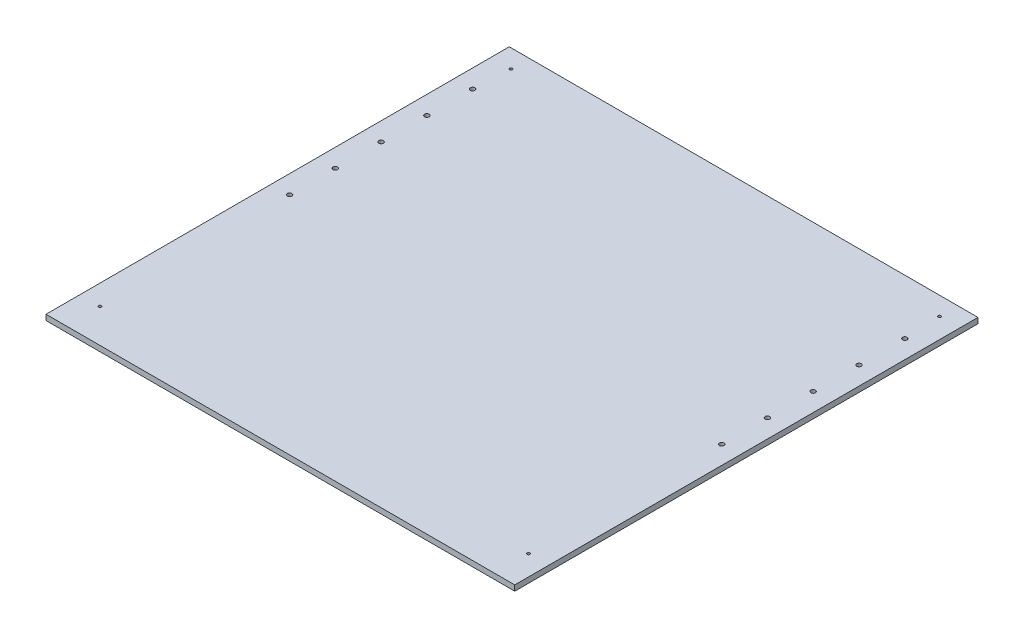
ISO-10303-21;
HEADER;
FILE_DESCRIPTION(('STEP AP214'),'2;1');
FILE_NAME('part.step','',(''),(''),'','','');
FILE_SCHEMA(('AUTOMOTIVE_DESIGN { 1 0 10303 214 1 1 1 1 }'));
ENDSEC;
DATA;
#1=APPLICATION_CONTEXT('core data for automotive mechanical design processes');
#2=APPLICATION_PROTOCOL_DEFINITION('international standard','automotive_design',2000,#1);
#3=PRODUCT_CONTEXT('',#1,'mechanical');
#4=PRODUCT('Part','Part','',(#3));
#5=PRODUCT_RELATED_PRODUCT_CATEGORY('part','',(#4));
#6=PRODUCT_DEFINITION_FORMATION('','',#4);
#7=PRODUCT_DEFINITION_CONTEXT('part definition',#1,'design');
#8=PRODUCT_DEFINITION('design','',#6,#7);
#9=PRODUCT_DEFINITION_SHAPE('','',#8);
#10=(LENGTH_UNIT() NAMED_UNIT(*) SI_UNIT(.MILLI.,.METRE.));
#11=(NAMED_UNIT(*) PLANE_ANGLE_UNIT() SI_UNIT($,.RADIAN.));
#12=(NAMED_UNIT(*) SI_UNIT($,.STERADIAN.) SOLID_ANGLE_UNIT());
#13=UNCERTAINTY_MEASURE_WITH_UNIT(LENGTH_MEASURE(1.E-05),#10,'distance_accuracy_value','');
#14=(GEOMETRIC_REPRESENTATION_CONTEXT(3) GLOBAL_UNCERTAINTY_ASSIGNED_CONTEXT((#13)) GLOBAL_UNIT_ASSIGNED_CONTEXT((#10,
#11,#12)) REPRESENTATION_CONTEXT('',''));
#15=CARTESIAN_POINT('',(0.,0.,0.));
#16=DIRECTION('',(0.,0.,1.));
#17=DIRECTION('',(1.,0.,0.));
#18=AXIS2_PLACEMENT_3D('',#15,#16,#17);
#19=CARTESIAN_POINT('',(0.,6.,0.));
#20=DIRECTION('',(0.,1.,0.));
#21=DIRECTION('',(0.,0.,1.));
#22=AXIS2_PLACEMENT_3D('',#19,#20,#21);
#23=PLANE('',#22);
#24=CARTESIAN_POINT('',(13.9999999999995,6.,210.));
#25=DIRECTION('',(0.,-1.,0.));
#26=DIRECTION('',(0.,0.,-1.));
#27=AXIS2_PLACEMENT_3D('',#24,#25,#26);
#28=CIRCLE('',#27,2.50000000000001);
#29=CARTESIAN_POINT('',(13.9999999999995,6.,207.5));
#30=VERTEX_POINT('',#29);
#31=EDGE_CURVE('E185',#30,#30,#28,.T.);
#32=ORIENTED_EDGE('',*,*,#31,.T.);
#33=EDGE_LOOP('',(#32));
#34=FACE_BOUND('',#33,.T.);
#35=CARTESIAN_POINT('',(13.9999999999997,6.,160.));
#36=DIRECTION('',(0.,-1.,0.));
#37=DIRECTION('',(0.,0.,-1.));
#38=AXIS2_PLACEMENT_3D('',#35,#36,#37);
#39=CIRCLE('',#38,2.5);
#40=CARTESIAN_POINT('',(13.9999999999997,6.,157.5));
#41=VERTEX_POINT('',#40);
#42=EDGE_CURVE('E189',#41,#41,#39,.T.);
#43=ORIENTED_EDGE('',*,*,#42,.T.);
#44=EDGE_LOOP('',(#43));
#45=FACE_BOUND('',#44,.T.);
#46=CARTESIAN_POINT('',(13.9999999999998,6.,110.));
#47=DIRECTION('',(0.,-1.,0.));
#48=DIRECTION('',(0.,0.,-1.));
#49=AXIS2_PLACEMENT_3D('',#46,#47,#48);
#50=CIRCLE('',#49,2.50000000000001);
#51=CARTESIAN_POINT('',(13.9999999999998,6.,107.5));
#52=VERTEX_POINT('',#51);
#53=EDGE_CURVE('E193',#52,#52,#50,.T.);
#54=ORIENTED_EDGE('',*,*,#53,.T.);
#55=EDGE_LOOP('',(#54));
#56=FACE_BOUND('',#55,.T.);
#57=CARTESIAN_POINT('',(14.,6.,60.));
#58=DIRECTION('',(0.,-1.,0.));
#59=DIRECTION('',(0.,0.,-1.));
#60=AXIS2_PLACEMENT_3D('',#57,#58,#59);
#61=CIRCLE('',#60,2.5);
#62=CARTESIAN_POINT('',(14.,6.,57.5));
#63=VERTEX_POINT('',#62);
#64=EDGE_CURVE('E197',#63,#63,#61,.T.);
#65=ORIENTED_EDGE('',*,*,#64,.T.);
#66=EDGE_LOOP('',(#65));
#67=FACE_BOUND('',#66,.T.);
#68=CARTESIAN_POINT('',(486.000000000001,6.,210.));
#69=DIRECTION('',(0.,-1.,0.));
#70=DIRECTION('',(0.,0.,-1.));
#71=AXIS2_PLACEMENT_3D('',#68,#69,#70);
#72=CIRCLE('',#71,2.49999999999997);
#73=CARTESIAN_POINT('',(486.000000000001,6.,207.5));
#74=VERTEX_POINT('',#73);
#75=EDGE_CURVE('E201',#74,#74,#72,.F.);
#76=ORIENTED_EDGE('',*,*,#75,.F.);
#77=EDGE_LOOP('',(#76));
#78=FACE_BOUND('',#77,.T.);
#79=CARTESIAN_POINT('',(486.,6.,110.));
#80=DIRECTION('',(0.,-1.,0.));
#81=DIRECTION('',(0.,0.,-1.));
#82=AXIS2_PLACEMENT_3D('',#79,#80,#81);
#83=CIRCLE('',#82,2.50000000000008);
#84=CARTESIAN_POINT('',(486.,6.,107.5));
#85=VERTEX_POINT('',#84);
#86=EDGE_CURVE('E205',#85,#85,#83,.F.);
#87=ORIENTED_EDGE('',*,*,#86,.F.);
#88=EDGE_LOOP('',(#87));
#89=FACE_BOUND('',#88,.T.);
#90=CARTESIAN_POINT('',(484.,6.,469.));
#91=DIRECTION('',(0.,1.,0.));
#92=DIRECTION('',(0.,0.,1.));
#93=AXIS2_PLACEMENT_3D('',#90,#91,#92);
#94=CIRCLE('',#93,1.50000000000002);
#95=CARTESIAN_POINT('',(484.,6.,470.5));
#96=VERTEX_POINT('',#95);
#97=EDGE_CURVE('E128',#96,#96,#94,.T.);
#98=ORIENTED_EDGE('',*,*,#97,.F.);
#99=EDGE_LOOP('',(#98));
#100=FACE_BOUND('',#99,.T.);
#101=CARTESIAN_POINT('',(16.,6.,19.9999999999999));
#102=DIRECTION('',(0.,1.,0.));
#103=DIRECTION('',(0.,0.,1.));
#104=AXIS2_PLACEMENT_3D('',#101,#102,#103);
#105=CIRCLE('',#104,1.50000000000016);
#106=CARTESIAN_POINT('',(16.,6.,21.5000000000001));
#107=VERTEX_POINT('',#106);
#108=EDGE_CURVE('E144',#107,#107,#105,.T.);
#109=ORIENTED_EDGE('',*,*,#108,.F.);
#110=EDGE_LOOP('',(#109));
#111=FACE_BOUND('',#110,.T.);
#112=DIRECTION('',(-1.,0.,0.));
#113=VECTOR('',#112,1.);
#114=CARTESIAN_POINT('',(0.,6.,0.));
#115=LINE('',#114,#113);
#116=CARTESIAN_POINT('',(506.,6.,0.));
#117=VERTEX_POINT('',#116);
#118=CARTESIAN_POINT('',(-5.99999999999994,6.,-1.11022302462516E-13));
#119=VERTEX_POINT('',#118);
#120=EDGE_CURVE('E11',#117,#119,#115,.T.);
#121=ORIENTED_EDGE('',*,*,#120,.T.);
#122=DIRECTION('',(0.,0.,-1.));
#123=VECTOR('',#122,1.);
#124=CARTESIAN_POINT('',(-6.,6.,506.));
#125=LINE('',#124,#123);
#126=CARTESIAN_POINT('',(-6.,6.,506.));
#127=VERTEX_POINT('',#126);
#128=EDGE_CURVE('E90',#127,#119,#125,.T.);
#129=ORIENTED_EDGE('',*,*,#128,.F.);
#130=DIRECTION('',(-1.,0.,0.));
#131=VECTOR('',#130,1.);
#132=CARTESIAN_POINT('',(506.,6.,506.));
#133=LINE('',#132,#131);
#134=CARTESIAN_POINT('',(506.,6.,506.));
#135=VERTEX_POINT('',#134);
#136=EDGE_CURVE('E100',#135,#127,#133,.T.);
#137=ORIENTED_EDGE('',*,*,#136,.F.);
#138=DIRECTION('',(0.,0.,1.));
#139=VECTOR('',#138,1.);
#140=CARTESIAN_POINT('',(506.,6.,0.));
#141=LINE('',#140,#139);
#142=EDGE_CURVE('E106',#117,#135,#141,.T.);
#143=ORIENTED_EDGE('',*,*,#142,.F.);
#144=EDGE_LOOP('',(#121,#129,#137,#143));
#145=FACE_BOUND('',#144,.T.);
#146=CARTESIAN_POINT('',(484.,6.,20.));
#147=DIRECTION('',(0.,1.,0.));
#148=DIRECTION('',(0.,0.,1.));
#149=AXIS2_PLACEMENT_3D('',#146,#147,#148);
#150=CIRCLE('',#149,1.52499999999982);
#151=CARTESIAN_POINT('',(484.,6.,21.5249999999998));
#152=VERTEX_POINT('',#151);
#153=EDGE_CURVE('E152',#152,#152,#150,.T.);
#154=ORIENTED_EDGE('',*,*,#153,.F.);
#155=EDGE_LOOP('',(#154));
#156=FACE_BOUND('',#155,.T.);
#157=CARTESIAN_POINT('',(16.0000000000001,6.,469.));
#158=DIRECTION('',(0.,1.,0.));
#159=DIRECTION('',(0.,0.,1.));
#160=AXIS2_PLACEMENT_3D('',#157,#158,#159);
#161=CIRCLE('',#160,1.5);
#162=CARTESIAN_POINT('',(16.0000000000001,6.,470.5));
#163=VERTEX_POINT('',#162);
#164=EDGE_CURVE('E136',#163,#163,#161,.T.);
#165=ORIENTED_EDGE('',*,*,#164,.F.);
#166=EDGE_LOOP('',(#165));
#167=FACE_BOUND('',#166,.T.);
#168=CARTESIAN_POINT('',(13.9999999999993,6.,260.));
#169=DIRECTION('',(0.,-1.,0.));
#170=DIRECTION('',(0.,0.,-1.));
#171=AXIS2_PLACEMENT_3D('',#168,#169,#170);
#172=CIRCLE('',#171,2.5);
#173=CARTESIAN_POINT('',(13.9999999999993,6.,257.5));
#174=VERTEX_POINT('',#173);
#175=EDGE_CURVE('E116',#174,#174,#172,.T.);
#176=ORIENTED_EDGE('',*,*,#175,.T.);
#177=EDGE_LOOP('',(#176));
#178=FACE_BOUND('',#177,.T.);
#179=CARTESIAN_POINT('',(486.,6.,60.));
#180=DIRECTION('',(0.,-1.,0.));
#181=DIRECTION('',(0.,0.,-1.));
#182=AXIS2_PLACEMENT_3D('',#179,#180,#181);
#183=CIRCLE('',#182,2.50000000000002);
#184=CARTESIAN_POINT('',(486.,6.,57.5));
#185=VERTEX_POINT('',#184);
#186=EDGE_CURVE('E259',#185,#185,#183,.F.);
#187=ORIENTED_EDGE('',*,*,#186,.F.);
#188=EDGE_LOOP('',(#187));
#189=FACE_BOUND('',#188,.T.);
#190=CARTESIAN_POINT('',(486.,6.,160.));
#191=DIRECTION('',(0.,-1.,0.));
#192=DIRECTION('',(0.,0.,-1.));
#193=AXIS2_PLACEMENT_3D('',#190,#191,#192);
#194=CIRCLE('',#193,2.50000000000002);
#195=CARTESIAN_POINT('',(486.,6.,157.5));
#196=VERTEX_POINT('',#195);
#197=EDGE_CURVE('E249',#196,#196,#194,.F.);
#198=ORIENTED_EDGE('',*,*,#197,.F.);
#199=EDGE_LOOP('',(#198));
#200=FACE_BOUND('',#199,.T.);
#201=CARTESIAN_POINT('',(486.000000000001,6.,260.));
#202=DIRECTION('',(0.,-1.,0.));
#203=DIRECTION('',(0.,0.,-1.));
#204=AXIS2_PLACEMENT_3D('',#201,#202,#203);
#205=CIRCLE('',#204,2.49999999999997);
#206=CARTESIAN_POINT('',(486.000000000001,6.,257.5));
#207=VERTEX_POINT('',#206);
#208=EDGE_CURVE('E237',#207,#207,#205,.F.);
#209=ORIENTED_EDGE('',*,*,#208,.F.);
#210=EDGE_LOOP('',(#209));
#211=FACE_BOUND('',#210,.T.);
#212=ADVANCED_FACE('F39',(#34,#45,#56,#67,#78,#89,#100,#111,#145,#156,#167,#178,#189,#200,#211),
#23,.T.);
#213=CARTESIAN_POINT('',(0.,0.,0.));
#214=DIRECTION('',(0.,1.,0.));
#215=DIRECTION('',(0.,0.,1.));
#216=AXIS2_PLACEMENT_3D('',#213,#214,#215);
#217=PLANE('',#216);
#218=CARTESIAN_POINT('',(13.9999999999995,0.,210.));
#219=DIRECTION('',(0.,-1.,0.));
#220=DIRECTION('',(0.,0.,-1.));
#221=AXIS2_PLACEMENT_3D('',#218,#219,#220);
#222=CIRCLE('',#221,2.50000000000001);
#223=CARTESIAN_POINT('',(13.9999999999995,0.,207.5));
#224=VERTEX_POINT('',#223);
#225=EDGE_CURVE('E268',#224,#224,#222,.T.);
#226=ORIENTED_EDGE('',*,*,#225,.F.);
#227=EDGE_LOOP('',(#226));
#228=FACE_BOUND('',#227,.T.);
#229=CARTESIAN_POINT('',(13.9999999999997,0.,160.));
#230=DIRECTION('',(0.,-1.,0.));
#231=DIRECTION('',(0.,0.,-1.));
#232=AXIS2_PLACEMENT_3D('',#229,#230,#231);
#233=CIRCLE('',#232,2.5);
#234=CARTESIAN_POINT('',(13.9999999999997,0.,157.5));
#235=VERTEX_POINT('',#234);
#236=EDGE_CURVE('E278',#235,#235,#233,.T.);
#237=ORIENTED_EDGE('',*,*,#236,.F.);
#238=EDGE_LOOP('',(#237));
#239=FACE_BOUND('',#238,.T.);
#240=CARTESIAN_POINT('',(13.9999999999998,0.,110.));
#241=DIRECTION('',(0.,-1.,0.));
#242=DIRECTION('',(0.,0.,-1.));
#243=AXIS2_PLACEMENT_3D('',#240,#241,#242);
#244=CIRCLE('',#243,2.50000000000001);
#245=CARTESIAN_POINT('',(13.9999999999998,0.,107.5));
#246=VERTEX_POINT('',#245);
#247=EDGE_CURVE('E284',#246,#246,#244,.T.);
#248=ORIENTED_EDGE('',*,*,#247,.F.);
#249=EDGE_LOOP('',(#248));
#250=FACE_BOUND('',#249,.T.);
#251=CARTESIAN_POINT('',(14.,0.,60.));
#252=DIRECTION('',(0.,-1.,0.));
#253=DIRECTION('',(0.,0.,-1.));
#254=AXIS2_PLACEMENT_3D('',#251,#252,#253);
#255=CIRCLE('',#254,2.5);
#256=CARTESIAN_POINT('',(14.,0.,57.5));
#257=VERTEX_POINT('',#256);
#258=EDGE_CURVE('E242',#257,#257,#255,.T.);
#259=ORIENTED_EDGE('',*,*,#258,.F.);
#260=EDGE_LOOP('',(#259));
#261=FACE_BOUND('',#260,.T.);
#262=CARTESIAN_POINT('',(13.9999999999993,0.,260.));
#263=DIRECTION('',(0.,-1.,0.));
#264=DIRECTION('',(0.,0.,-1.));
#265=AXIS2_PLACEMENT_3D('',#262,#263,#264);
#266=CIRCLE('',#265,2.5);
#267=CARTESIAN_POINT('',(13.9999999999993,0.,257.5));
#268=VERTEX_POINT('',#267);
#269=EDGE_CURVE('E262',#268,#268,#266,.T.);
#270=ORIENTED_EDGE('',*,*,#269,.F.);
#271=EDGE_LOOP('',(#270));
#272=FACE_BOUND('',#271,.T.);
#273=DIRECTION('',(0.,0.,-1.));
#274=VECTOR('',#273,1.);
#275=CARTESIAN_POINT('',(-6.,0.,506.));
#276=LINE('',#275,#274);
#277=CARTESIAN_POINT('',(-6.,0.,506.));
#278=VERTEX_POINT('',#277);
#279=CARTESIAN_POINT('',(-5.99999999999994,0.,-1.11022302462516E-13));
#280=VERTEX_POINT('',#279);
#281=EDGE_CURVE('E91',#278,#280,#276,.T.);
#282=ORIENTED_EDGE('',*,*,#281,.T.);
#283=DIRECTION('',(-1.,0.,0.));
#284=VECTOR('',#283,1.);
#285=CARTESIAN_POINT('',(0.,0.,0.));
#286=LINE('',#285,#284);
#287=CARTESIAN_POINT('',(506.,0.,0.));
#288=VERTEX_POINT('',#287);
#289=EDGE_CURVE('E43',#288,#280,#286,.T.);
#290=ORIENTED_EDGE('',*,*,#289,.F.);
#291=DIRECTION('',(0.,0.,1.));
#292=VECTOR('',#291,1.);
#293=CARTESIAN_POINT('',(506.,0.,0.));
#294=LINE('',#293,#292);
#295=CARTESIAN_POINT('',(506.,0.,506.));
#296=VERTEX_POINT('',#295);
#297=EDGE_CURVE('E102',#288,#296,#294,.T.);
#298=ORIENTED_EDGE('',*,*,#297,.T.);
#299=DIRECTION('',(-1.,0.,0.));
#300=VECTOR('',#299,1.);
#301=CARTESIAN_POINT('',(506.,0.,506.));
#302=LINE('',#301,#300);
#303=EDGE_CURVE('E115',#296,#278,#302,.T.);
#304=ORIENTED_EDGE('',*,*,#303,.T.);
#305=EDGE_LOOP('',(#282,#290,#298,#304));
#306=FACE_BOUND('',#305,.T.);
#307=CARTESIAN_POINT('',(484.,0.,20.));
#308=DIRECTION('',(0.,1.,0.));
#309=DIRECTION('',(0.,0.,1.));
#310=AXIS2_PLACEMENT_3D('',#307,#308,#309);
#311=CIRCLE('',#310,1.52499999999982);
#312=CARTESIAN_POINT('',(484.,0.,21.5249999999998));
#313=VERTEX_POINT('',#312);
#314=EDGE_CURVE('E148',#313,#313,#311,.T.);
#315=ORIENTED_EDGE('',*,*,#314,.T.);
#316=EDGE_LOOP('',(#315));
#317=FACE_BOUND('',#316,.T.);
#318=CARTESIAN_POINT('',(16.,0.,19.9999999999999));
#319=DIRECTION('',(0.,1.,0.));
#320=DIRECTION('',(0.,0.,1.));
#321=AXIS2_PLACEMENT_3D('',#318,#319,#320);
#322=CIRCLE('',#321,1.50000000000016);
#323=CARTESIAN_POINT('',(16.,0.,21.5000000000001));
#324=VERTEX_POINT('',#323);
#325=EDGE_CURVE('E140',#324,#324,#322,.T.);
#326=ORIENTED_EDGE('',*,*,#325,.T.);
#327=EDGE_LOOP('',(#326));
#328=FACE_BOUND('',#327,.T.);
#329=CARTESIAN_POINT('',(16.0000000000001,0.,469.));
#330=DIRECTION('',(0.,1.,0.));
#331=DIRECTION('',(0.,0.,1.));
#332=AXIS2_PLACEMENT_3D('',#329,#330,#331);
#333=CIRCLE('',#332,1.5);
#334=CARTESIAN_POINT('',(16.0000000000001,0.,470.5));
#335=VERTEX_POINT('',#334);
#336=EDGE_CURVE('E132',#335,#335,#333,.T.);
#337=ORIENTED_EDGE('',*,*,#336,.T.);
#338=EDGE_LOOP('',(#337));
#339=FACE_BOUND('',#338,.T.);
#340=CARTESIAN_POINT('',(484.,0.,469.));
#341=DIRECTION('',(0.,1.,0.));
#342=DIRECTION('',(0.,0.,1.));
#343=AXIS2_PLACEMENT_3D('',#340,#341,#342);
#344=CIRCLE('',#343,1.50000000000002);
#345=CARTESIAN_POINT('',(484.,0.,470.5));
#346=VERTEX_POINT('',#345);
#347=EDGE_CURVE('E127',#346,#346,#344,.T.);
#348=ORIENTED_EDGE('',*,*,#347,.T.);
#349=EDGE_LOOP('',(#348));
#350=FACE_BOUND('',#349,.T.);
#351=CARTESIAN_POINT('',(486.,0.,60.));
#352=DIRECTION('',(0.,-1.,0.));
#353=DIRECTION('',(0.,0.,-1.));
#354=AXIS2_PLACEMENT_3D('',#351,#352,#353);
#355=CIRCLE('',#354,2.50000000000002);
#356=CARTESIAN_POINT('',(486.,0.,57.5));
#357=VERTEX_POINT('',#356);
#358=EDGE_CURVE('E219',#357,#357,#355,.F.);
#359=ORIENTED_EDGE('',*,*,#358,.T.);
#360=EDGE_LOOP('',(#359));
#361=FACE_BOUND('',#360,.T.);
#362=CARTESIAN_POINT('',(486.,0.,110.));
#363=DIRECTION('',(0.,-1.,0.));
#364=DIRECTION('',(0.,0.,-1.));
#365=AXIS2_PLACEMENT_3D('',#362,#363,#364);
#366=CIRCLE('',#365,2.50000000000008);
#367=CARTESIAN_POINT('',(486.,0.,107.5));
#368=VERTEX_POINT('',#367);
#369=EDGE_CURVE('E223',#368,#368,#366,.F.);
#370=ORIENTED_EDGE('',*,*,#369,.T.);
#371=EDGE_LOOP('',(#370));
#372=FACE_BOUND('',#371,.T.);
#373=CARTESIAN_POINT('',(486.,0.,160.));
#374=DIRECTION('',(0.,-1.,0.));
#375=DIRECTION('',(0.,0.,-1.));
#376=AXIS2_PLACEMENT_3D('',#373,#374,#375);
#377=CIRCLE('',#376,2.50000000000002);
#378=CARTESIAN_POINT('',(486.,0.,157.5));
#379=VERTEX_POINT('',#378);
#380=EDGE_CURVE('E227',#379,#379,#377,.F.);
#381=ORIENTED_EDGE('',*,*,#380,.T.);
#382=EDGE_LOOP('',(#381));
#383=FACE_BOUND('',#382,.T.);
#384=CARTESIAN_POINT('',(486.000000000001,0.,210.));
#385=DIRECTION('',(0.,-1.,0.));
#386=DIRECTION('',(0.,0.,-1.));
#387=AXIS2_PLACEMENT_3D('',#384,#385,#386);
#388=CIRCLE('',#387,2.49999999999997);
#389=CARTESIAN_POINT('',(486.000000000001,0.,207.5));
#390=VERTEX_POINT('',#389);
#391=EDGE_CURVE('E231',#390,#390,#388,.F.);
#392=ORIENTED_EDGE('',*,*,#391,.T.);
#393=EDGE_LOOP('',(#392));
#394=FACE_BOUND('',#393,.T.);
#395=CARTESIAN_POINT('',(486.000000000001,0.,260.));
#396=DIRECTION('',(0.,-1.,0.));
#397=DIRECTION('',(0.,0.,-1.));
#398=AXIS2_PLACEMENT_3D('',#395,#396,#397);
#399=CIRCLE('',#398,2.49999999999997);
#400=CARTESIAN_POINT('',(486.000000000001,0.,257.5));
#401=VERTEX_POINT('',#400);
#402=EDGE_CURVE('E234',#401,#401,#399,.F.);
#403=ORIENTED_EDGE('',*,*,#402,.T.);
#404=EDGE_LOOP('',(#403));
#405=FACE_BOUND('',#404,.T.);
#406=ADVANCED_FACE('F160',(#228,#239,#250,#261,#272,#306,#317,#328,#339,#350,#361,#372,#383,
#394,#405),#217,.F.);
#407=CARTESIAN_POINT('',(0.,6.,0.));
#408=DIRECTION('',(0.,0.,1.));
#409=DIRECTION('',(1.,0.,0.));
#410=AXIS2_PLACEMENT_3D('',#407,#408,#409);
#411=PLANE('',#410);
#412=ORIENTED_EDGE('',*,*,#289,.T.);
#413=DIRECTION('',(0.,-1.,0.));
#414=VECTOR('',#413,1.);
#415=CARTESIAN_POINT('',(-5.99999999999994,6.,-1.11022302462516E-13));
#416=LINE('',#415,#414);
#417=EDGE_CURVE('E96',#119,#280,#416,.T.);
#418=ORIENTED_EDGE('',*,*,#417,.F.);
#419=ORIENTED_EDGE('',*,*,#120,.F.);
#420=DIRECTION('',(0.,-1.,0.));
#421=VECTOR('',#420,1.);
#422=CARTESIAN_POINT('',(506.,6.,0.));
#423=LINE('',#422,#421);
#424=EDGE_CURVE('E109',#117,#288,#423,.T.);
#425=ORIENTED_EDGE('',*,*,#424,.T.);
#426=EDGE_LOOP('',(#412,#418,#419,#425));
#427=FACE_BOUND('',#426,.T.);
#428=ADVANCED_FACE('F41',(#427),#411,.F.);
#429=CARTESIAN_POINT('',(484.,6.,20.));
#430=DIRECTION('',(0.,-1.,0.));
#431=DIRECTION('',(0.,0.,-1.));
#432=AXIS2_PLACEMENT_3D('',#429,#430,#431);
#433=CYLINDRICAL_SURFACE('',#432,1.52499999999982);
#434=ORIENTED_EDGE('',*,*,#153,.T.);
#435=EDGE_LOOP('',(#434));
#436=FACE_BOUND('',#435,.T.);
#437=ORIENTED_EDGE('',*,*,#314,.F.);
#438=EDGE_LOOP('',(#437));
#439=FACE_BOUND('',#438,.T.);
#440=ADVANCED_FACE('F163',(#436,#439),#433,.F.);
#441=CARTESIAN_POINT('',(16.,6.,19.9999999999999));
#442=DIRECTION('',(0.,-1.,0.));
#443=DIRECTION('',(0.,0.,-1.));
#444=AXIS2_PLACEMENT_3D('',#441,#442,#443);
#445=CYLINDRICAL_SURFACE('',#444,1.50000000000016);
#446=ORIENTED_EDGE('',*,*,#108,.T.);
#447=EDGE_LOOP('',(#446));
#448=FACE_BOUND('',#447,.T.);
#449=ORIENTED_EDGE('',*,*,#325,.F.);
#450=EDGE_LOOP('',(#449));
#451=FACE_BOUND('',#450,.T.);
#452=ADVANCED_FACE('F165',(#448,#451),#445,.F.);
#453=CARTESIAN_POINT('',(16.0000000000001,6.,469.));
#454=DIRECTION('',(0.,-1.,0.));
#455=DIRECTION('',(0.,0.,-1.));
#456=AXIS2_PLACEMENT_3D('',#453,#454,#455);
#457=CYLINDRICAL_SURFACE('',#456,1.5);
#458=ORIENTED_EDGE('',*,*,#164,.T.);
#459=EDGE_LOOP('',(#458));
#460=FACE_BOUND('',#459,.T.);
#461=ORIENTED_EDGE('',*,*,#336,.F.);
#462=EDGE_LOOP('',(#461));
#463=FACE_BOUND('',#462,.T.);
#464=ADVANCED_FACE('F172',(#460,#463),#457,.F.);
#465=CARTESIAN_POINT('',(484.,6.,469.));
#466=DIRECTION('',(0.,-1.,0.));
#467=DIRECTION('',(0.,0.,-1.));
#468=AXIS2_PLACEMENT_3D('',#465,#466,#467);
#469=CYLINDRICAL_SURFACE('',#468,1.50000000000002);
#470=ORIENTED_EDGE('',*,*,#97,.T.);
#471=EDGE_LOOP('',(#470));
#472=FACE_BOUND('',#471,.T.);
#473=ORIENTED_EDGE('',*,*,#347,.F.);
#474=EDGE_LOOP('',(#473));
#475=FACE_BOUND('',#474,.T.);
#476=ADVANCED_FACE('F313',(#472,#475),#469,.F.);
#477=CARTESIAN_POINT('',(-6.,6.,506.));
#478=DIRECTION('',(-1.,0.,0.));
#479=DIRECTION('',(0.,0.,1.));
#480=AXIS2_PLACEMENT_3D('',#477,#478,#479);
#481=PLANE('',#480);
#482=ORIENTED_EDGE('',*,*,#281,.F.);
#483=DIRECTION('',(0.,-1.,0.));
#484=VECTOR('',#483,1.);
#485=CARTESIAN_POINT('',(-6.,6.,506.));
#486=LINE('',#485,#484);
#487=EDGE_CURVE('E87',#127,#278,#486,.T.);
#488=ORIENTED_EDGE('',*,*,#487,.F.);
#489=ORIENTED_EDGE('',*,*,#128,.T.);
#490=ORIENTED_EDGE('',*,*,#417,.T.);
#491=EDGE_LOOP('',(#482,#488,#489,#490));
#492=FACE_BOUND('',#491,.T.);
#493=ADVANCED_FACE('F88',(#492),#481,.T.);
#494=CARTESIAN_POINT('',(506.,6.,506.));
#495=DIRECTION('',(0.,0.,1.));
#496=DIRECTION('',(1.,0.,0.));
#497=AXIS2_PLACEMENT_3D('',#494,#495,#496);
#498=PLANE('',#497);
#499=ORIENTED_EDGE('',*,*,#303,.F.);
#500=DIRECTION('',(0.,-1.,0.));
#501=VECTOR('',#500,1.);
#502=CARTESIAN_POINT('',(506.,6.,506.));
#503=LINE('',#502,#501);
#504=EDGE_CURVE('E72',#135,#296,#503,.T.);
#505=ORIENTED_EDGE('',*,*,#504,.F.);
#506=ORIENTED_EDGE('',*,*,#136,.T.);
#507=ORIENTED_EDGE('',*,*,#487,.T.);
#508=EDGE_LOOP('',(#499,#505,#506,#507));
#509=FACE_BOUND('',#508,.T.);
#510=ADVANCED_FACE('F104',(#509),#498,.T.);
#511=CARTESIAN_POINT('',(506.,6.,0.));
#512=DIRECTION('',(1.,0.,0.));
#513=DIRECTION('',(0.,0.,-1.));
#514=AXIS2_PLACEMENT_3D('',#511,#512,#513);
#515=PLANE('',#514);
#516=ORIENTED_EDGE('',*,*,#297,.F.);
#517=ORIENTED_EDGE('',*,*,#424,.F.);
#518=ORIENTED_EDGE('',*,*,#142,.T.);
#519=ORIENTED_EDGE('',*,*,#504,.T.);
#520=EDGE_LOOP('',(#516,#517,#518,#519));
#521=FACE_BOUND('',#520,.T.);
#522=ADVANCED_FACE('F296',(#521),#515,.T.);
#523=CARTESIAN_POINT('',(13.9999999999993,6.,260.));
#524=DIRECTION('',(0.,-1.,0.));
#525=DIRECTION('',(0.,0.,-1.));
#526=AXIS2_PLACEMENT_3D('',#523,#524,#525);
#527=CYLINDRICAL_SURFACE('',#526,2.5);
#528=ORIENTED_EDGE('',*,*,#175,.F.);
#529=EDGE_LOOP('',(#528));
#530=FACE_BOUND('',#529,.T.);
#531=ORIENTED_EDGE('',*,*,#269,.T.);
#532=EDGE_LOOP('',(#531));
#533=FACE_BOUND('',#532,.T.);
#534=ADVANCED_FACE('F299',(#530,#533),#527,.F.);
#535=CARTESIAN_POINT('',(486.,6.,60.));
#536=DIRECTION('',(0.,-1.,0.));
#537=DIRECTION('',(0.,0.,-1.));
#538=AXIS2_PLACEMENT_3D('',#535,#536,#537);
#539=CYLINDRICAL_SURFACE('',#538,2.50000000000002);
#540=ORIENTED_EDGE('',*,*,#186,.T.);
#541=EDGE_LOOP('',(#540));
#542=FACE_BOUND('',#541,.T.);
#543=ORIENTED_EDGE('',*,*,#358,.F.);
#544=EDGE_LOOP('',(#543));
#545=FACE_BOUND('',#544,.T.);
#546=ADVANCED_FACE('F305',(#542,#545),#539,.F.);
#547=CARTESIAN_POINT('',(486.,6.,110.));
#548=DIRECTION('',(0.,-1.,0.));
#549=DIRECTION('',(0.,0.,-1.));
#550=AXIS2_PLACEMENT_3D('',#547,#548,#549);
#551=CYLINDRICAL_SURFACE('',#550,2.50000000000008);
#552=ORIENTED_EDGE('',*,*,#86,.T.);
#553=EDGE_LOOP('',(#552));
#554=FACE_BOUND('',#553,.T.);
#555=ORIENTED_EDGE('',*,*,#369,.F.);
#556=EDGE_LOOP('',(#555));
#557=FACE_BOUND('',#556,.T.);
#558=ADVANCED_FACE('F351',(#554,#557),#551,.F.);
#559=CARTESIAN_POINT('',(486.,6.,160.));
#560=DIRECTION('',(0.,-1.,0.));
#561=DIRECTION('',(0.,0.,-1.));
#562=AXIS2_PLACEMENT_3D('',#559,#560,#561);
#563=CYLINDRICAL_SURFACE('',#562,2.50000000000002);
#564=ORIENTED_EDGE('',*,*,#197,.T.);
#565=EDGE_LOOP('',(#564));
#566=FACE_BOUND('',#565,.T.);
#567=ORIENTED_EDGE('',*,*,#380,.F.);
#568=EDGE_LOOP('',(#567));
#569=FACE_BOUND('',#568,.T.);
#570=ADVANCED_FACE('F345',(#566,#569),#563,.F.);
#571=CARTESIAN_POINT('',(486.000000000001,6.,210.));
#572=DIRECTION('',(0.,-1.,0.));
#573=DIRECTION('',(0.,0.,-1.));
#574=AXIS2_PLACEMENT_3D('',#571,#572,#573);
#575=CYLINDRICAL_SURFACE('',#574,2.49999999999997);
#576=ORIENTED_EDGE('',*,*,#75,.T.);
#577=EDGE_LOOP('',(#576));
#578=FACE_BOUND('',#577,.T.);
#579=ORIENTED_EDGE('',*,*,#391,.F.);
#580=EDGE_LOOP('',(#579));
#581=FACE_BOUND('',#580,.T.);
#582=ADVANCED_FACE('F336',(#578,#581),#575,.F.);
#583=CARTESIAN_POINT('',(486.000000000001,6.,260.));
#584=DIRECTION('',(0.,-1.,0.));
#585=DIRECTION('',(0.,0.,-1.));
#586=AXIS2_PLACEMENT_3D('',#583,#584,#585);
#587=CYLINDRICAL_SURFACE('',#586,2.49999999999997);
#588=ORIENTED_EDGE('',*,*,#208,.T.);
#589=EDGE_LOOP('',(#588));
#590=FACE_BOUND('',#589,.T.);
#591=ORIENTED_EDGE('',*,*,#402,.F.);
#592=EDGE_LOOP('',(#591));
#593=FACE_BOUND('',#592,.T.);
#594=ADVANCED_FACE('F334',(#590,#593),#587,.F.);
#595=CARTESIAN_POINT('',(14.,6.,60.));
#596=DIRECTION('',(0.,-1.,0.));
#597=DIRECTION('',(0.,0.,-1.));
#598=AXIS2_PLACEMENT_3D('',#595,#596,#597);
#599=CYLINDRICAL_SURFACE('',#598,2.5);
#600=ORIENTED_EDGE('',*,*,#64,.F.);
#601=EDGE_LOOP('',(#600));
#602=FACE_BOUND('',#601,.T.);
#603=ORIENTED_EDGE('',*,*,#258,.T.);
#604=EDGE_LOOP('',(#603));
#605=FACE_BOUND('',#604,.T.);
#606=ADVANCED_FACE('F293',(#602,#605),#599,.F.);
#607=CARTESIAN_POINT('',(13.9999999999998,6.,110.));
#608=DIRECTION('',(0.,-1.,0.));
#609=DIRECTION('',(0.,0.,-1.));
#610=AXIS2_PLACEMENT_3D('',#607,#608,#609);
#611=CYLINDRICAL_SURFACE('',#610,2.50000000000001);
#612=ORIENTED_EDGE('',*,*,#53,.F.);
#613=EDGE_LOOP('',(#612));
#614=FACE_BOUND('',#613,.T.);
#615=ORIENTED_EDGE('',*,*,#247,.T.);
#616=EDGE_LOOP('',(#615));
#617=FACE_BOUND('',#616,.T.);
#618=ADVANCED_FACE('F342',(#614,#617),#611,.F.);
#619=CARTESIAN_POINT('',(13.9999999999997,6.,160.));
#620=DIRECTION('',(0.,-1.,0.));
#621=DIRECTION('',(0.,0.,-1.));
#622=AXIS2_PLACEMENT_3D('',#619,#620,#621);
#623=CYLINDRICAL_SURFACE('',#622,2.5);
#624=ORIENTED_EDGE('',*,*,#42,.F.);
#625=EDGE_LOOP('',(#624));
#626=FACE_BOUND('',#625,.T.);
#627=ORIENTED_EDGE('',*,*,#236,.T.);
#628=EDGE_LOOP('',(#627));
#629=FACE_BOUND('',#628,.T.);
#630=ADVANCED_FACE('F368',(#626,#629),#623,.F.);
#631=CARTESIAN_POINT('',(13.9999999999995,6.,210.));
#632=DIRECTION('',(0.,-1.,0.));
#633=DIRECTION('',(0.,0.,-1.));
#634=AXIS2_PLACEMENT_3D('',#631,#632,#633);
#635=CYLINDRICAL_SURFACE('',#634,2.50000000000001);
#636=ORIENTED_EDGE('',*,*,#31,.F.);
#637=EDGE_LOOP('',(#636));
#638=FACE_BOUND('',#637,.T.);
#639=ORIENTED_EDGE('',*,*,#225,.T.);
#640=EDGE_LOOP('',(#639));
#641=FACE_BOUND('',#640,.T.);
#642=ADVANCED_FACE('F365',(#638,#641),#635,.F.);
#643=CLOSED_SHELL('',(#212,#406,#428,#440,#452,#464,#476,#493,#510,#522,#534,#546,#558,#570,
#582,#594,#606,#618,#630,#642));
#644=MANIFOLD_SOLID_BREP('B2',#643);
#645=ADVANCED_BREP_SHAPE_REPRESENTATION('',(#18,#644),#14);
#646=SHAPE_DEFINITION_REPRESENTATION(#9,#645);
ENDSEC;
END-ISO-10303-21;
